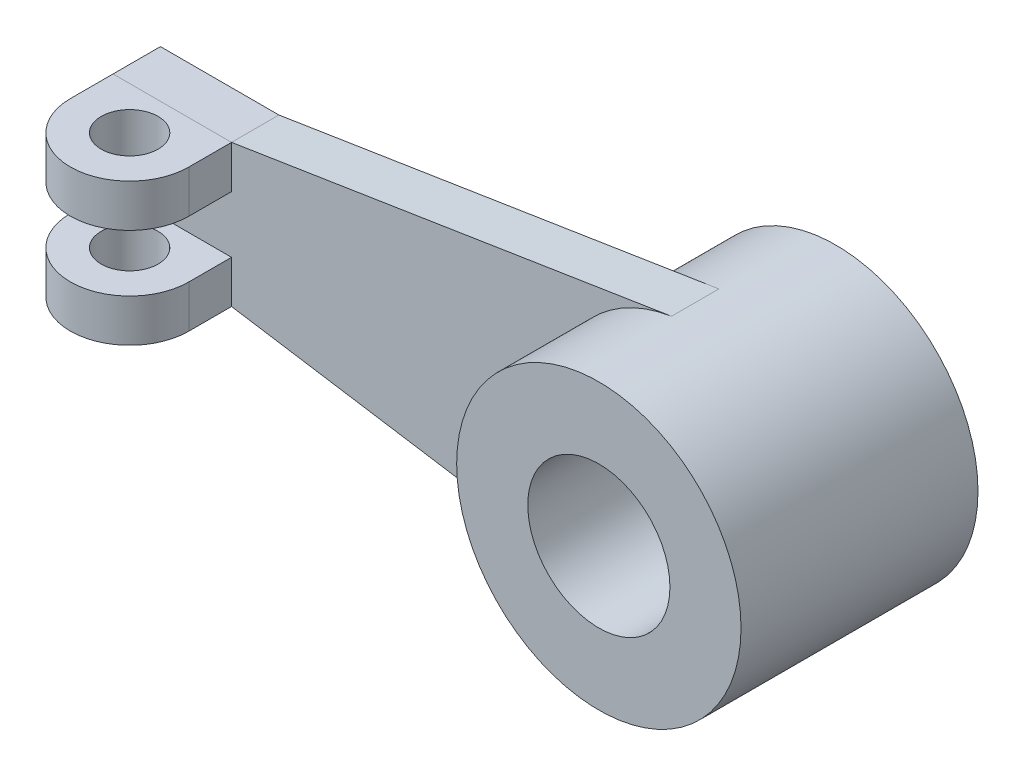
ISO-10303-21;
HEADER;
FILE_DESCRIPTION(('STEP AP214'),'2;1');
FILE_NAME('part.step','',(''),(''),'','','');
FILE_SCHEMA(('AUTOMOTIVE_DESIGN { 1 0 10303 214 1 1 1 1 }'));
ENDSEC;
DATA;
#1=APPLICATION_CONTEXT('core data for automotive mechanical design processes');
#2=APPLICATION_PROTOCOL_DEFINITION('international standard','automotive_design',2000,#1);
#3=PRODUCT_CONTEXT('',#1,'mechanical');
#4=PRODUCT('Part','Part','',(#3));
#5=PRODUCT_RELATED_PRODUCT_CATEGORY('part','',(#4));
#6=PRODUCT_DEFINITION_FORMATION('','',#4);
#7=PRODUCT_DEFINITION_CONTEXT('part definition',#1,'design');
#8=PRODUCT_DEFINITION('design','',#6,#7);
#9=PRODUCT_DEFINITION_SHAPE('','',#8);
#10=(LENGTH_UNIT() NAMED_UNIT(*) SI_UNIT(.MILLI.,.METRE.));
#11=(NAMED_UNIT(*) PLANE_ANGLE_UNIT() SI_UNIT($,.RADIAN.));
#12=(NAMED_UNIT(*) SI_UNIT($,.STERADIAN.) SOLID_ANGLE_UNIT());
#13=UNCERTAINTY_MEASURE_WITH_UNIT(LENGTH_MEASURE(1.E-05),#10,'distance_accuracy_value','');
#14=(GEOMETRIC_REPRESENTATION_CONTEXT(3) GLOBAL_UNCERTAINTY_ASSIGNED_CONTEXT((#13)) GLOBAL_UNIT_ASSIGNED_CONTEXT((#10,
#11,#12)) REPRESENTATION_CONTEXT('',''));
#15=CARTESIAN_POINT('',(0.,0.,0.));
#16=DIRECTION('',(0.,0.,1.));
#17=DIRECTION('',(1.,0.,0.));
#18=AXIS2_PLACEMENT_3D('',#15,#16,#17);
#19=CARTESIAN_POINT('',(-110.,6.,14.));
#20=DIRECTION('',(0.,1.,0.));
#21=DIRECTION('',(1.,0.,0.));
#22=AXIS2_PLACEMENT_3D('',#19,#20,#21);
#23=CYLINDRICAL_SURFACE('',#22,12.5);
#24=CARTESIAN_POINT('',(-110.,15.,14.));
#25=DIRECTION('',(0.,-1.,0.));
#26=DIRECTION('',(1.,0.,0.));
#27=AXIS2_PLACEMENT_3D('',#24,#25,#26);
#28=CIRCLE('',#27,12.5);
#29=CARTESIAN_POINT('',(-122.5,15.,14.));
#30=VERTEX_POINT('',#29);
#31=CARTESIAN_POINT('',(-97.5,15.,14.));
#32=VERTEX_POINT('',#31);
#33=EDGE_CURVE('E113',#30,#32,#28,.F.);
#34=ORIENTED_EDGE('',*,*,#33,.F.);
#35=DIRECTION('',(0.,1.,0.));
#36=VECTOR('',#35,1.);
#37=CARTESIAN_POINT('',(-122.5,6.00000000000001,14.));
#38=LINE('',#37,#36);
#39=CARTESIAN_POINT('',(-122.5,6.00000000000001,14.));
#40=VERTEX_POINT('',#39);
#41=EDGE_CURVE('E49',#40,#30,#38,.T.);
#42=ORIENTED_EDGE('',*,*,#41,.F.);
#43=CARTESIAN_POINT('',(-110.,6.,14.));
#44=DIRECTION('',(0.,-1.,0.));
#45=DIRECTION('',(1.,0.,0.));
#46=AXIS2_PLACEMENT_3D('',#43,#44,#45);
#47=CIRCLE('',#46,12.5);
#48=CARTESIAN_POINT('',(-97.5,6.,14.));
#49=VERTEX_POINT('',#48);
#50=EDGE_CURVE('E99',#40,#49,#47,.F.);
#51=ORIENTED_EDGE('',*,*,#50,.T.);
#52=DIRECTION('',(0.,1.,0.));
#53=VECTOR('',#52,1.);
#54=CARTESIAN_POINT('',(-97.5,6.,14.));
#55=LINE('',#54,#53);
#56=EDGE_CURVE('E12',#49,#32,#55,.T.);
#57=ORIENTED_EDGE('',*,*,#56,.T.);
#58=EDGE_LOOP('',(#34,#42,#51,#57));
#59=FACE_BOUND('',#58,.T.);
#60=ADVANCED_FACE('F45',(#59),#23,.T.);
#61=CARTESIAN_POINT('',(-97.5,6.,0.));
#62=DIRECTION('',(-1.,0.,0.));
#63=DIRECTION('',(0.,1.,0.));
#64=AXIS2_PLACEMENT_3D('',#61,#62,#63);
#65=PLANE('',#64);
#66=DIRECTION('',(0.,0.,-1.));
#67=VECTOR('',#66,1.);
#68=CARTESIAN_POINT('',(-97.5,15.,0.));
#69=LINE('',#68,#67);
#70=CARTESIAN_POINT('',(-97.5,15.,5.));
#71=VERTEX_POINT('',#70);
#72=EDGE_CURVE('E87',#32,#71,#69,.T.);
#73=ORIENTED_EDGE('',*,*,#72,.F.);
#74=ORIENTED_EDGE('',*,*,#56,.F.);
#75=DIRECTION('',(0.,0.,-1.));
#76=VECTOR('',#75,1.);
#77=CARTESIAN_POINT('',(-97.5,6.,0.));
#78=LINE('',#77,#76);
#79=CARTESIAN_POINT('',(-97.5,6.,5.));
#80=VERTEX_POINT('',#79);
#81=EDGE_CURVE('E64',#49,#80,#78,.T.);
#82=ORIENTED_EDGE('',*,*,#81,.T.);
#83=DIRECTION('',(0.,1.,0.));
#84=VECTOR('',#83,1.);
#85=CARTESIAN_POINT('',(-97.5,6.,5.));
#86=LINE('',#85,#84);
#87=EDGE_CURVE('E55',#80,#71,#86,.T.);
#88=ORIENTED_EDGE('',*,*,#87,.T.);
#89=EDGE_LOOP('',(#73,#74,#82,#88));
#90=FACE_BOUND('',#89,.T.);
#91=ADVANCED_FACE('F120',(#90),#65,.F.);
#92=CARTESIAN_POINT('',(0.,5.99999999999997,5.));
#93=DIRECTION('',(0.,0.,1.));
#94=DIRECTION('',(1.,0.,0.));
#95=AXIS2_PLACEMENT_3D('',#92,#93,#94);
#96=PLANE('',#95);
#97=DIRECTION('',(-1.,0.,0.));
#98=VECTOR('',#97,1.);
#99=CARTESIAN_POINT('',(0.,15.,5.));
#100=LINE('',#99,#98);
#101=CARTESIAN_POINT('',(-122.5,15.,5.));
#102=VERTEX_POINT('',#101);
#103=EDGE_CURVE('E81',#71,#102,#100,.T.);
#104=ORIENTED_EDGE('',*,*,#103,.F.);
#105=ORIENTED_EDGE('',*,*,#87,.F.);
#106=DIRECTION('',(-1.,0.,0.));
#107=VECTOR('',#106,1.);
#108=CARTESIAN_POINT('',(0.,5.99999999999997,5.));
#109=LINE('',#108,#107);
#110=CARTESIAN_POINT('',(-122.5,6.00000000000001,5.));
#111=VERTEX_POINT('',#110);
#112=EDGE_CURVE('E97',#80,#111,#109,.T.);
#113=ORIENTED_EDGE('',*,*,#112,.T.);
#114=DIRECTION('',(0.,1.,0.));
#115=VECTOR('',#114,1.);
#116=CARTESIAN_POINT('',(-122.5,6.00000000000001,5.));
#117=LINE('',#116,#115);
#118=EDGE_CURVE('E102',#111,#102,#117,.T.);
#119=ORIENTED_EDGE('',*,*,#118,.T.);
#120=EDGE_LOOP('',(#104,#105,#113,#119));
#121=FACE_BOUND('',#120,.T.);
#122=ADVANCED_FACE('F105',(#121),#96,.F.);
#123=CARTESIAN_POINT('',(-110.,6.,14.));
#124=DIRECTION('',(0.,1.,0.));
#125=DIRECTION('',(1.,0.,0.));
#126=AXIS2_PLACEMENT_3D('',#123,#124,#125);
#127=CYLINDRICAL_SURFACE('',#126,6.);
#128=CARTESIAN_POINT('',(-110.,6.,14.));
#129=DIRECTION('',(0.,-1.,0.));
#130=DIRECTION('',(1.,0.,0.));
#131=AXIS2_PLACEMENT_3D('',#128,#129,#130);
#132=CIRCLE('',#131,6.);
#133=CARTESIAN_POINT('',(-104.,6.,14.));
#134=VERTEX_POINT('',#133);
#135=EDGE_CURVE('E118',#134,#134,#132,.T.);
#136=ORIENTED_EDGE('',*,*,#135,.T.);
#137=EDGE_LOOP('',(#136));
#138=FACE_BOUND('',#137,.T.);
#139=CARTESIAN_POINT('',(-110.,15.,14.));
#140=DIRECTION('',(0.,-1.,0.));
#141=DIRECTION('',(1.,0.,0.));
#142=AXIS2_PLACEMENT_3D('',#139,#140,#141);
#143=CIRCLE('',#142,6.);
#144=CARTESIAN_POINT('',(-104.,15.,14.));
#145=VERTEX_POINT('',#144);
#146=EDGE_CURVE('E110',#145,#145,#143,.T.);
#147=ORIENTED_EDGE('',*,*,#146,.F.);
#148=EDGE_LOOP('',(#147));
#149=FACE_BOUND('',#148,.T.);
#150=ADVANCED_FACE('F47',(#138,#149),#127,.F.);
#151=CARTESIAN_POINT('',(-122.5,6.00000000000001,0.));
#152=DIRECTION('',(1.,0.,0.));
#153=DIRECTION('',(0.,-1.,0.));
#154=AXIS2_PLACEMENT_3D('',#151,#152,#153);
#155=PLANE('',#154);
#156=DIRECTION('',(0.,0.,1.));
#157=VECTOR('',#156,1.);
#158=CARTESIAN_POINT('',(-122.5,15.,0.));
#159=LINE('',#158,#157);
#160=EDGE_CURVE('E104',#102,#30,#159,.T.);
#161=ORIENTED_EDGE('',*,*,#160,.F.);
#162=ORIENTED_EDGE('',*,*,#118,.F.);
#163=DIRECTION('',(0.,0.,1.));
#164=VECTOR('',#163,1.);
#165=CARTESIAN_POINT('',(-122.5,6.00000000000001,0.));
#166=LINE('',#165,#164);
#167=EDGE_CURVE('E94',#111,#40,#166,.T.);
#168=ORIENTED_EDGE('',*,*,#167,.T.);
#169=ORIENTED_EDGE('',*,*,#41,.T.);
#170=EDGE_LOOP('',(#161,#162,#168,#169));
#171=FACE_BOUND('',#170,.T.);
#172=ADVANCED_FACE('F103',(#171),#155,.F.);
#173=CARTESIAN_POINT('',(0.,5.99999999999997,0.));
#174=DIRECTION('',(0.,1.,0.));
#175=DIRECTION('',(1.,0.,0.));
#176=AXIS2_PLACEMENT_3D('',#173,#174,#175);
#177=PLANE('',#176);
#178=ORIENTED_EDGE('',*,*,#135,.F.);
#179=EDGE_LOOP('',(#178));
#180=FACE_BOUND('',#179,.T.);
#181=ORIENTED_EDGE('',*,*,#50,.F.);
#182=ORIENTED_EDGE('',*,*,#167,.F.);
#183=ORIENTED_EDGE('',*,*,#112,.F.);
#184=ORIENTED_EDGE('',*,*,#81,.F.);
#185=EDGE_LOOP('',(#181,#182,#183,#184));
#186=FACE_BOUND('',#185,.T.);
#187=ADVANCED_FACE('F95',(#180,#186),#177,.F.);
#188=CARTESIAN_POINT('',(0.,15.,0.));
#189=DIRECTION('',(0.,1.,0.));
#190=DIRECTION('',(1.,0.,0.));
#191=AXIS2_PLACEMENT_3D('',#188,#189,#190);
#192=PLANE('',#191);
#193=ORIENTED_EDGE('',*,*,#146,.T.);
#194=EDGE_LOOP('',(#193));
#195=FACE_BOUND('',#194,.T.);
#196=ORIENTED_EDGE('',*,*,#33,.T.);
#197=ORIENTED_EDGE('',*,*,#72,.T.);
#198=ORIENTED_EDGE('',*,*,#103,.T.);
#199=ORIENTED_EDGE('',*,*,#160,.T.);
#200=EDGE_LOOP('',(#196,#197,#198,#199));
#201=FACE_BOUND('',#200,.T.);
#202=ADVANCED_FACE('F122',(#195,#201),#192,.T.);
#203=CLOSED_SHELL('',(#60,#91,#122,#150,#172,#187,#202));
#204=MANIFOLD_SOLID_BREP('B2',#203);
#205=CARTESIAN_POINT('',(-110.,-6.,14.));
#206=DIRECTION('',(0.,-1.,0.));
#207=DIRECTION('',(1.,0.,0.));
#208=AXIS2_PLACEMENT_3D('',#205,#206,#207);
#209=CYLINDRICAL_SURFACE('',#208,12.5);
#210=CARTESIAN_POINT('',(-110.,-15.,14.));
#211=DIRECTION('',(0.,-1.,0.));
#212=DIRECTION('',(1.,0.,0.));
#213=AXIS2_PLACEMENT_3D('',#210,#211,#212);
#214=CIRCLE('',#213,12.5);
#215=CARTESIAN_POINT('',(-122.5,-15.,14.));
#216=VERTEX_POINT('',#215);
#217=CARTESIAN_POINT('',(-97.5,-15.,14.));
#218=VERTEX_POINT('',#217);
#219=EDGE_CURVE('E268',#216,#218,#214,.F.);
#220=ORIENTED_EDGE('',*,*,#219,.T.);
#221=DIRECTION('',(0.,-1.,0.));
#222=VECTOR('',#221,1.);
#223=CARTESIAN_POINT('',(-97.5,-6.,14.));
#224=LINE('',#223,#222);
#225=CARTESIAN_POINT('',(-97.5,-6.,14.));
#226=VERTEX_POINT('',#225);
#227=EDGE_CURVE('E43',#226,#218,#224,.T.);
#228=ORIENTED_EDGE('',*,*,#227,.F.);
#229=CARTESIAN_POINT('',(-110.,-6.,14.));
#230=DIRECTION('',(0.,-1.,0.));
#231=DIRECTION('',(1.,0.,0.));
#232=AXIS2_PLACEMENT_3D('',#229,#230,#231);
#233=CIRCLE('',#232,12.5);
#234=CARTESIAN_POINT('',(-122.5,-6.00000000000001,14.));
#235=VERTEX_POINT('',#234);
#236=EDGE_CURVE('E258',#235,#226,#233,.F.);
#237=ORIENTED_EDGE('',*,*,#236,.F.);
#238=DIRECTION('',(0.,-1.,0.));
#239=VECTOR('',#238,1.);
#240=CARTESIAN_POINT('',(-122.5,-6.00000000000001,14.));
#241=LINE('',#240,#239);
#242=EDGE_CURVE('E202',#235,#216,#241,.T.);
#243=ORIENTED_EDGE('',*,*,#242,.T.);
#244=EDGE_LOOP('',(#220,#228,#237,#243));
#245=FACE_BOUND('',#244,.T.);
#246=ADVANCED_FACE('F198',(#245),#209,.T.);
#247=CARTESIAN_POINT('',(-97.5,-6.,0.));
#248=DIRECTION('',(-1.,0.,0.));
#249=DIRECTION('',(0.,-1.,0.));
#250=AXIS2_PLACEMENT_3D('',#247,#248,#249);
#251=PLANE('',#250);
#252=DIRECTION('',(0.,0.,-1.));
#253=VECTOR('',#252,1.);
#254=CARTESIAN_POINT('',(-97.5,-15.,0.));
#255=LINE('',#254,#253);
#256=CARTESIAN_POINT('',(-97.5,-15.,5.));
#257=VERTEX_POINT('',#256);
#258=EDGE_CURVE('E230',#218,#257,#255,.T.);
#259=ORIENTED_EDGE('',*,*,#258,.T.);
#260=DIRECTION('',(0.,-1.,0.));
#261=VECTOR('',#260,1.);
#262=CARTESIAN_POINT('',(-97.5,-6.,5.));
#263=LINE('',#262,#261);
#264=CARTESIAN_POINT('',(-97.5,-6.,5.));
#265=VERTEX_POINT('',#264);
#266=EDGE_CURVE('E208',#265,#257,#263,.T.);
#267=ORIENTED_EDGE('',*,*,#266,.F.);
#268=DIRECTION('',(0.,0.,-1.));
#269=VECTOR('',#268,1.);
#270=CARTESIAN_POINT('',(-97.5,-6.,0.));
#271=LINE('',#270,#269);
#272=EDGE_CURVE('E216',#226,#265,#271,.T.);
#273=ORIENTED_EDGE('',*,*,#272,.F.);
#274=ORIENTED_EDGE('',*,*,#227,.T.);
#275=EDGE_LOOP('',(#259,#267,#273,#274));
#276=FACE_BOUND('',#275,.T.);
#277=ADVANCED_FACE('F278',(#276),#251,.F.);
#278=CARTESIAN_POINT('',(0.,-5.99999999999997,5.));
#279=DIRECTION('',(0.,0.,1.));
#280=DIRECTION('',(1.,0.,0.));
#281=AXIS2_PLACEMENT_3D('',#278,#279,#280);
#282=PLANE('',#281);
#283=DIRECTION('',(-1.,0.,0.));
#284=VECTOR('',#283,1.);
#285=CARTESIAN_POINT('',(0.,-15.,5.));
#286=LINE('',#285,#284);
#287=CARTESIAN_POINT('',(-122.5,-15.,5.));
#288=VERTEX_POINT('',#287);
#289=EDGE_CURVE('E252',#257,#288,#286,.T.);
#290=ORIENTED_EDGE('',*,*,#289,.T.);
#291=DIRECTION('',(0.,-1.,0.));
#292=VECTOR('',#291,1.);
#293=CARTESIAN_POINT('',(-122.5,-6.00000000000001,5.));
#294=LINE('',#293,#292);
#295=CARTESIAN_POINT('',(-122.5,-6.00000000000001,5.));
#296=VERTEX_POINT('',#295);
#297=EDGE_CURVE('E250',#296,#288,#294,.T.);
#298=ORIENTED_EDGE('',*,*,#297,.F.);
#299=DIRECTION('',(-1.,0.,0.));
#300=VECTOR('',#299,1.);
#301=CARTESIAN_POINT('',(0.,-5.99999999999997,5.));
#302=LINE('',#301,#300);
#303=EDGE_CURVE('E244',#265,#296,#302,.T.);
#304=ORIENTED_EDGE('',*,*,#303,.F.);
#305=ORIENTED_EDGE('',*,*,#266,.T.);
#306=EDGE_LOOP('',(#290,#298,#304,#305));
#307=FACE_BOUND('',#306,.T.);
#308=ADVANCED_FACE('F251',(#307),#282,.F.);
#309=CARTESIAN_POINT('',(-110.,-6.,14.));
#310=DIRECTION('',(0.,-1.,0.));
#311=DIRECTION('',(1.,0.,0.));
#312=AXIS2_PLACEMENT_3D('',#309,#310,#311);
#313=CYLINDRICAL_SURFACE('',#312,6.);
#314=CARTESIAN_POINT('',(-110.,-6.,14.));
#315=DIRECTION('',(0.,-1.,0.));
#316=DIRECTION('',(1.,0.,0.));
#317=AXIS2_PLACEMENT_3D('',#314,#315,#316);
#318=CIRCLE('',#317,6.);
#319=CARTESIAN_POINT('',(-104.,-6.,14.));
#320=VERTEX_POINT('',#319);
#321=EDGE_CURVE('E260',#320,#320,#318,.T.);
#322=ORIENTED_EDGE('',*,*,#321,.F.);
#323=EDGE_LOOP('',(#322));
#324=FACE_BOUND('',#323,.T.);
#325=CARTESIAN_POINT('',(-110.,-15.,14.));
#326=DIRECTION('',(0.,-1.,0.));
#327=DIRECTION('',(1.,0.,0.));
#328=AXIS2_PLACEMENT_3D('',#325,#326,#327);
#329=CIRCLE('',#328,6.);
#330=CARTESIAN_POINT('',(-104.,-15.,14.));
#331=VERTEX_POINT('',#330);
#332=EDGE_CURVE('E265',#331,#331,#329,.T.);
#333=ORIENTED_EDGE('',*,*,#332,.T.);
#334=EDGE_LOOP('',(#333));
#335=FACE_BOUND('',#334,.T.);
#336=ADVANCED_FACE('F200',(#324,#335),#313,.F.);
#337=CARTESIAN_POINT('',(-122.5,-6.00000000000001,0.));
#338=DIRECTION('',(1.,0.,0.));
#339=DIRECTION('',(0.,1.,0.));
#340=AXIS2_PLACEMENT_3D('',#337,#338,#339);
#341=PLANE('',#340);
#342=DIRECTION('',(0.,0.,1.));
#343=VECTOR('',#342,1.);
#344=CARTESIAN_POINT('',(-122.5,-15.,0.));
#345=LINE('',#344,#343);
#346=EDGE_CURVE('E271',#288,#216,#345,.T.);
#347=ORIENTED_EDGE('',*,*,#346,.T.);
#348=ORIENTED_EDGE('',*,*,#242,.F.);
#349=DIRECTION('',(0.,0.,1.));
#350=VECTOR('',#349,1.);
#351=CARTESIAN_POINT('',(-122.5,-6.00000000000001,0.));
#352=LINE('',#351,#350);
#353=EDGE_CURVE('E241',#296,#235,#352,.T.);
#354=ORIENTED_EDGE('',*,*,#353,.F.);
#355=ORIENTED_EDGE('',*,*,#297,.T.);
#356=EDGE_LOOP('',(#347,#348,#354,#355));
#357=FACE_BOUND('',#356,.T.);
#358=ADVANCED_FACE('F255',(#357),#341,.F.);
#359=CARTESIAN_POINT('',(0.,-5.99999999999997,0.));
#360=DIRECTION('',(0.,-1.,0.));
#361=DIRECTION('',(1.,0.,0.));
#362=AXIS2_PLACEMENT_3D('',#359,#360,#361);
#363=PLANE('',#362);
#364=ORIENTED_EDGE('',*,*,#321,.T.);
#365=EDGE_LOOP('',(#364));
#366=FACE_BOUND('',#365,.T.);
#367=ORIENTED_EDGE('',*,*,#236,.T.);
#368=ORIENTED_EDGE('',*,*,#272,.T.);
#369=ORIENTED_EDGE('',*,*,#303,.T.);
#370=ORIENTED_EDGE('',*,*,#353,.T.);
#371=EDGE_LOOP('',(#367,#368,#369,#370));
#372=FACE_BOUND('',#371,.T.);
#373=ADVANCED_FACE('F246',(#366,#372),#363,.F.);
#374=CARTESIAN_POINT('',(0.,-15.,0.));
#375=DIRECTION('',(0.,-1.,0.));
#376=DIRECTION('',(1.,0.,0.));
#377=AXIS2_PLACEMENT_3D('',#374,#375,#376);
#378=PLANE('',#377);
#379=ORIENTED_EDGE('',*,*,#332,.F.);
#380=EDGE_LOOP('',(#379));
#381=FACE_BOUND('',#380,.T.);
#382=ORIENTED_EDGE('',*,*,#219,.F.);
#383=ORIENTED_EDGE('',*,*,#346,.F.);
#384=ORIENTED_EDGE('',*,*,#289,.F.);
#385=ORIENTED_EDGE('',*,*,#258,.F.);
#386=EDGE_LOOP('',(#382,#383,#384,#385));
#387=FACE_BOUND('',#386,.T.);
#388=ADVANCED_FACE('F275',(#381,#387),#378,.T.);
#389=CLOSED_SHELL('',(#246,#277,#308,#336,#358,#373,#388));
#390=MANIFOLD_SOLID_BREP('B6',#389);
#391=CARTESIAN_POINT('',(-4.67168875625144,-29.6340230843656,-5.));
#392=DIRECTION('',(-0.155722958541715,-0.987800769478854,0.));
#393=DIRECTION('',(0.987800769478854,-0.155722958541715,0.));
#394=AXIS2_PLACEMENT_3D('',#391,#392,#393);
#395=PLANE('',#394);
#396=DIRECTION('',(0.,0.,1.));
#397=VECTOR('',#396,1.);
#398=CARTESIAN_POINT('',(-4.67168875625144,-29.6340230843656,-5.));
#399=LINE('',#398,#397);
#400=CARTESIAN_POINT('',(-4.67168875625144,-29.6340230843656,-5.));
#401=VERTEX_POINT('',#400);
#402=CARTESIAN_POINT('',(-4.67168875625144,-29.6340230843656,5.));
#403=VERTEX_POINT('',#402);
#404=EDGE_CURVE('E196',#401,#403,#399,.T.);
#405=ORIENTED_EDGE('',*,*,#404,.T.);
#406=DIRECTION('',(0.987800769478854,-0.155722958541715,0.));
#407=VECTOR('',#406,1.);
#408=CARTESIAN_POINT('',(-4.67168875625144,-29.6340230843656,5.));
#409=LINE('',#408,#407);
#410=CARTESIAN_POINT('',(-97.5,-15.,5.));
#411=VERTEX_POINT('',#410);
#412=EDGE_CURVE('E396',#411,#403,#409,.T.);
#413=ORIENTED_EDGE('',*,*,#412,.F.);
#414=DIRECTION('',(0.,0.,1.));
#415=VECTOR('',#414,1.);
#416=CARTESIAN_POINT('',(-97.5,-15.,-5.));
#417=LINE('',#416,#415);
#418=CARTESIAN_POINT('',(-97.5,-15.,-5.));
#419=VERTEX_POINT('',#418);
#420=EDGE_CURVE('E351',#419,#411,#417,.T.);
#421=ORIENTED_EDGE('',*,*,#420,.F.);
#422=DIRECTION('',(0.987800769478854,-0.155722958541715,0.));
#423=VECTOR('',#422,1.);
#424=CARTESIAN_POINT('',(-4.67168875625144,-29.6340230843656,-5.));
#425=LINE('',#424,#423);
#426=EDGE_CURVE('E407',#419,#401,#425,.T.);
#427=ORIENTED_EDGE('',*,*,#426,.T.);
#428=EDGE_LOOP('',(#405,#413,#421,#427));
#429=FACE_BOUND('',#428,.T.);
#430=ADVANCED_FACE('F342',(#429),#395,.T.);
#431=CARTESIAN_POINT('',(0.,-15.,-5.));
#432=DIRECTION('',(0.,-1.,0.));
#433=DIRECTION('',(1.,0.,0.));
#434=AXIS2_PLACEMENT_3D('',#431,#432,#433);
#435=PLANE('',#434);
#436=ORIENTED_EDGE('',*,*,#420,.T.);
#437=DIRECTION('',(1.,0.,0.));
#438=VECTOR('',#437,1.);
#439=CARTESIAN_POINT('',(0.,-15.,5.));
#440=LINE('',#439,#438);
#441=CARTESIAN_POINT('',(-122.5,-15.,5.));
#442=VERTEX_POINT('',#441);
#443=EDGE_CURVE('E404',#442,#411,#440,.T.);
#444=ORIENTED_EDGE('',*,*,#443,.F.);
#445=DIRECTION('',(0.,0.,1.));
#446=VECTOR('',#445,1.);
#447=CARTESIAN_POINT('',(-122.5,-15.,-5.));
#448=LINE('',#447,#446);
#449=CARTESIAN_POINT('',(-122.5,-15.,-5.));
#450=VERTEX_POINT('',#449);
#451=EDGE_CURVE('E439',#450,#442,#448,.T.);
#452=ORIENTED_EDGE('',*,*,#451,.F.);
#453=DIRECTION('',(1.,0.,0.));
#454=VECTOR('',#453,1.);
#455=CARTESIAN_POINT('',(0.,-15.,-5.));
#456=LINE('',#455,#454);
#457=EDGE_CURVE('E435',#450,#419,#456,.T.);
#458=ORIENTED_EDGE('',*,*,#457,.T.);
#459=EDGE_LOOP('',(#436,#444,#452,#458));
#460=FACE_BOUND('',#459,.T.);
#461=ADVANCED_FACE('F456',(#460),#435,.T.);
#462=CARTESIAN_POINT('',(-122.5,0.,-5.));
#463=DIRECTION('',(1.,0.,0.));
#464=DIRECTION('',(0.,0.,-1.));
#465=AXIS2_PLACEMENT_3D('',#462,#463,#464);
#466=PLANE('',#465);
#467=ORIENTED_EDGE('',*,*,#451,.T.);
#468=DIRECTION('',(0.,1.,0.));
#469=VECTOR('',#468,1.);
#470=CARTESIAN_POINT('',(-122.5,0.,5.));
#471=LINE('',#470,#469);
#472=CARTESIAN_POINT('',(-122.5,15.,5.));
#473=VERTEX_POINT('',#472);
#474=EDGE_CURVE('E424',#442,#473,#471,.T.);
#475=ORIENTED_EDGE('',*,*,#474,.T.);
#476=DIRECTION('',(0.,0.,1.));
#477=VECTOR('',#476,1.);
#478=CARTESIAN_POINT('',(-122.5,15.,-5.));
#479=LINE('',#478,#477);
#480=CARTESIAN_POINT('',(-122.5,15.,-5.));
#481=VERTEX_POINT('',#480);
#482=EDGE_CURVE('E441',#481,#473,#479,.T.);
#483=ORIENTED_EDGE('',*,*,#482,.F.);
#484=DIRECTION('',(0.,1.,0.));
#485=VECTOR('',#484,1.);
#486=CARTESIAN_POINT('',(-122.5,0.,-5.));
#487=LINE('',#486,#485);
#488=EDGE_CURVE('E433',#450,#481,#487,.T.);
#489=ORIENTED_EDGE('',*,*,#488,.F.);
#490=EDGE_LOOP('',(#467,#475,#483,#489));
#491=FACE_BOUND('',#490,.T.);
#492=ADVANCED_FACE('F453',(#491),#466,.F.);
#493=CARTESIAN_POINT('',(0.,15.,-5.));
#494=DIRECTION('',(0.,-1.,0.));
#495=DIRECTION('',(1.,0.,0.));
#496=AXIS2_PLACEMENT_3D('',#493,#494,#495);
#497=PLANE('',#496);
#498=ORIENTED_EDGE('',*,*,#482,.T.);
#499=DIRECTION('',(1.,0.,0.));
#500=VECTOR('',#499,1.);
#501=CARTESIAN_POINT('',(0.,15.,5.));
#502=LINE('',#501,#500);
#503=CARTESIAN_POINT('',(-97.5,15.,5.));
#504=VERTEX_POINT('',#503);
#505=EDGE_CURVE('E415',#473,#504,#502,.T.);
#506=ORIENTED_EDGE('',*,*,#505,.T.);
#507=DIRECTION('',(0.,0.,1.));
#508=VECTOR('',#507,1.);
#509=CARTESIAN_POINT('',(-97.5,15.,-5.));
#510=LINE('',#509,#508);
#511=CARTESIAN_POINT('',(-97.5,15.,-5.));
#512=VERTEX_POINT('',#511);
#513=EDGE_CURVE('E442',#512,#504,#510,.T.);
#514=ORIENTED_EDGE('',*,*,#513,.F.);
#515=DIRECTION('',(1.,0.,0.));
#516=VECTOR('',#515,1.);
#517=CARTESIAN_POINT('',(0.,15.,-5.));
#518=LINE('',#517,#516);
#519=EDGE_CURVE('E431',#481,#512,#518,.T.);
#520=ORIENTED_EDGE('',*,*,#519,.F.);
#521=EDGE_LOOP('',(#498,#506,#514,#520));
#522=FACE_BOUND('',#521,.T.);
#523=ADVANCED_FACE('F449',(#522),#497,.F.);
#524=CARTESIAN_POINT('',(-4.67168875625145,29.6340230843656,-5.));
#525=DIRECTION('',(0.155722958541715,-0.987800769478854,0.));
#526=DIRECTION('',(0.987800769478854,0.155722958541715,0.));
#527=AXIS2_PLACEMENT_3D('',#524,#525,#526);
#528=PLANE('',#527);
#529=ORIENTED_EDGE('',*,*,#513,.T.);
#530=DIRECTION('',(0.987800769478854,0.155722958541715,0.));
#531=VECTOR('',#530,1.);
#532=CARTESIAN_POINT('',(-4.67168875625145,29.6340230843656,5.));
#533=LINE('',#532,#531);
#534=CARTESIAN_POINT('',(-4.67168875625145,29.6340230843656,5.));
#535=VERTEX_POINT('',#534);
#536=EDGE_CURVE('E412',#504,#535,#533,.T.);
#537=ORIENTED_EDGE('',*,*,#536,.T.);
#538=DIRECTION('',(0.,0.,1.));
#539=VECTOR('',#538,1.);
#540=CARTESIAN_POINT('',(-4.67168875625145,29.6340230843656,-5.));
#541=LINE('',#540,#539);
#542=CARTESIAN_POINT('',(-4.67168875625145,29.6340230843656,-5.));
#543=VERTEX_POINT('',#542);
#544=EDGE_CURVE('E346',#543,#535,#541,.T.);
#545=ORIENTED_EDGE('',*,*,#544,.F.);
#546=DIRECTION('',(0.987800769478854,0.155722958541715,0.));
#547=VECTOR('',#546,1.);
#548=CARTESIAN_POINT('',(-4.67168875625145,29.6340230843656,-5.));
#549=LINE('',#548,#547);
#550=EDGE_CURVE('E429',#512,#543,#549,.T.);
#551=ORIENTED_EDGE('',*,*,#550,.F.);
#552=EDGE_LOOP('',(#529,#537,#545,#551));
#553=FACE_BOUND('',#552,.T.);
#554=ADVANCED_FACE('F344',(#553),#528,.F.);
#555=CARTESIAN_POINT('',(0.,0.,-5.));
#556=DIRECTION('',(0.,0.,1.));
#557=DIRECTION('',(1.,0.,0.));
#558=AXIS2_PLACEMENT_3D('',#555,#556,#557);
#559=PLANE('',#558);
#560=CARTESIAN_POINT('',(0.,0.,-5.));
#561=DIRECTION('',(0.,0.,1.));
#562=DIRECTION('',(1.,0.,0.));
#563=AXIS2_PLACEMENT_3D('',#560,#561,#562);
#564=CIRCLE('',#563,30.);
#565=EDGE_CURVE('E359',#543,#401,#564,.T.);
#566=ORIENTED_EDGE('',*,*,#565,.T.);
#567=ORIENTED_EDGE('',*,*,#426,.F.);
#568=ORIENTED_EDGE('',*,*,#457,.F.);
#569=ORIENTED_EDGE('',*,*,#488,.T.);
#570=ORIENTED_EDGE('',*,*,#519,.T.);
#571=ORIENTED_EDGE('',*,*,#550,.T.);
#572=EDGE_LOOP('',(#566,#567,#568,#569,#570,#571));
#573=FACE_BOUND('',#572,.T.);
#574=ADVANCED_FACE('F457',(#573),#559,.F.);
#575=CARTESIAN_POINT('',(0.,0.,5.));
#576=DIRECTION('',(0.,0.,1.));
#577=DIRECTION('',(1.,0.,0.));
#578=AXIS2_PLACEMENT_3D('',#575,#576,#577);
#579=PLANE('',#578);
#580=CARTESIAN_POINT('',(0.,0.,5.));
#581=DIRECTION('',(0.,0.,1.));
#582=DIRECTION('',(1.,0.,0.));
#583=AXIS2_PLACEMENT_3D('',#580,#581,#582);
#584=CIRCLE('',#583,30.);
#585=EDGE_CURVE('E400',#535,#403,#584,.T.);
#586=ORIENTED_EDGE('',*,*,#585,.F.);
#587=ORIENTED_EDGE('',*,*,#536,.F.);
#588=ORIENTED_EDGE('',*,*,#505,.F.);
#589=ORIENTED_EDGE('',*,*,#474,.F.);
#590=ORIENTED_EDGE('',*,*,#443,.T.);
#591=ORIENTED_EDGE('',*,*,#412,.T.);
#592=EDGE_LOOP('',(#586,#587,#588,#589,#590,#591));
#593=FACE_BOUND('',#592,.T.);
#594=ADVANCED_FACE('F397',(#593),#579,.T.);
#595=CARTESIAN_POINT('',(0.,0.,25.));
#596=DIRECTION('',(0.,0.,-1.));
#597=DIRECTION('',(-1.,0.,0.));
#598=AXIS2_PLACEMENT_3D('',#595,#596,#597);
#599=CYLINDRICAL_SURFACE('',#598,30.);
#600=CARTESIAN_POINT('',(0.,0.,25.));
#601=DIRECTION('',(0.,0.,1.));
#602=DIRECTION('',(1.,0.,0.));
#603=AXIS2_PLACEMENT_3D('',#600,#601,#602);
#604=CIRCLE('',#603,30.);
#605=CARTESIAN_POINT('',(30.,0.,25.));
#606=VERTEX_POINT('',#605);
#607=EDGE_CURVE('E413',#606,#606,#604,.T.);
#608=ORIENTED_EDGE('',*,*,#607,.F.);
#609=EDGE_LOOP('',(#608));
#610=FACE_BOUND('',#609,.T.);
#611=CARTESIAN_POINT('',(0.,0.,-25.));
#612=DIRECTION('',(0.,0.,1.));
#613=DIRECTION('',(1.,0.,0.));
#614=AXIS2_PLACEMENT_3D('',#611,#612,#613);
#615=CIRCLE('',#614,30.);
#616=CARTESIAN_POINT('',(30.,0.,-25.));
#617=VERTEX_POINT('',#616);
#618=EDGE_CURVE('E418',#617,#617,#615,.T.);
#619=ORIENTED_EDGE('',*,*,#618,.T.);
#620=EDGE_LOOP('',(#619));
#621=FACE_BOUND('',#620,.T.);
#622=ORIENTED_EDGE('',*,*,#404,.F.);
#623=ORIENTED_EDGE('',*,*,#565,.F.);
#624=ORIENTED_EDGE('',*,*,#544,.T.);
#625=ORIENTED_EDGE('',*,*,#585,.T.);
#626=EDGE_LOOP('',(#622,#623,#624,#625));
#627=FACE_BOUND('',#626,.T.);
#628=ADVANCED_FACE('F410',(#610,#621,#627),#599,.T.);
#629=CARTESIAN_POINT('',(0.,0.,25.));
#630=DIRECTION('',(0.,0.,1.));
#631=DIRECTION('',(1.,0.,0.));
#632=AXIS2_PLACEMENT_3D('',#629,#630,#631);
#633=PLANE('',#632);
#634=ORIENTED_EDGE('',*,*,#607,.T.);
#635=EDGE_LOOP('',(#634));
#636=FACE_BOUND('',#635,.T.);
#637=CARTESIAN_POINT('',(0.,0.,25.));
#638=DIRECTION('',(0.,0.,1.));
#639=DIRECTION('',(1.,0.,0.));
#640=AXIS2_PLACEMENT_3D('',#637,#638,#639);
#641=CIRCLE('',#640,15.);
#642=CARTESIAN_POINT('',(15.,0.,25.));
#643=VERTEX_POINT('',#642);
#644=EDGE_CURVE('E542',#643,#643,#641,.T.);
#645=ORIENTED_EDGE('',*,*,#644,.F.);
#646=EDGE_LOOP('',(#645));
#647=FACE_BOUND('',#646,.T.);
#648=ADVANCED_FACE('F505',(#636,#647),#633,.T.);
#649=CARTESIAN_POINT('',(0.,0.,-25.));
#650=DIRECTION('',(0.,0.,1.));
#651=DIRECTION('',(1.,0.,0.));
#652=AXIS2_PLACEMENT_3D('',#649,#650,#651);
#653=PLANE('',#652);
#654=ORIENTED_EDGE('',*,*,#618,.F.);
#655=EDGE_LOOP('',(#654));
#656=FACE_BOUND('',#655,.T.);
#657=CARTESIAN_POINT('',(0.,0.,-25.));
#658=DIRECTION('',(0.,0.,1.));
#659=DIRECTION('',(1.,0.,0.));
#660=AXIS2_PLACEMENT_3D('',#657,#658,#659);
#661=CIRCLE('',#660,15.);
#662=CARTESIAN_POINT('',(15.,0.,-25.));
#663=VERTEX_POINT('',#662);
#664=EDGE_CURVE('E545',#663,#663,#661,.T.);
#665=ORIENTED_EDGE('',*,*,#664,.T.);
#666=EDGE_LOOP('',(#665));
#667=FACE_BOUND('',#666,.T.);
#668=ADVANCED_FACE('F515',(#656,#667),#653,.F.);
#669=CARTESIAN_POINT('',(0.,0.,25.));
#670=DIRECTION('',(0.,0.,-1.));
#671=DIRECTION('',(-1.,0.,0.));
#672=AXIS2_PLACEMENT_3D('',#669,#670,#671);
#673=CYLINDRICAL_SURFACE('',#672,15.);
#674=ORIENTED_EDGE('',*,*,#644,.T.);
#675=EDGE_LOOP('',(#674));
#676=FACE_BOUND('',#675,.T.);
#677=ORIENTED_EDGE('',*,*,#664,.F.);
#678=EDGE_LOOP('',(#677));
#679=FACE_BOUND('',#678,.T.);
#680=ADVANCED_FACE('F525',(#676,#679),#673,.F.);
#681=CLOSED_SHELL('',(#430,#461,#492,#523,#554,#574,#594,#628,#648,#668,#680));
#682=MANIFOLD_SOLID_BREP('B37',#681);
#683=ADVANCED_BREP_SHAPE_REPRESENTATION('',(#18,#204,#390,#682),#14);
#684=SHAPE_DEFINITION_REPRESENTATION(#9,#683);
ENDSEC;
END-ISO-10303-21;
